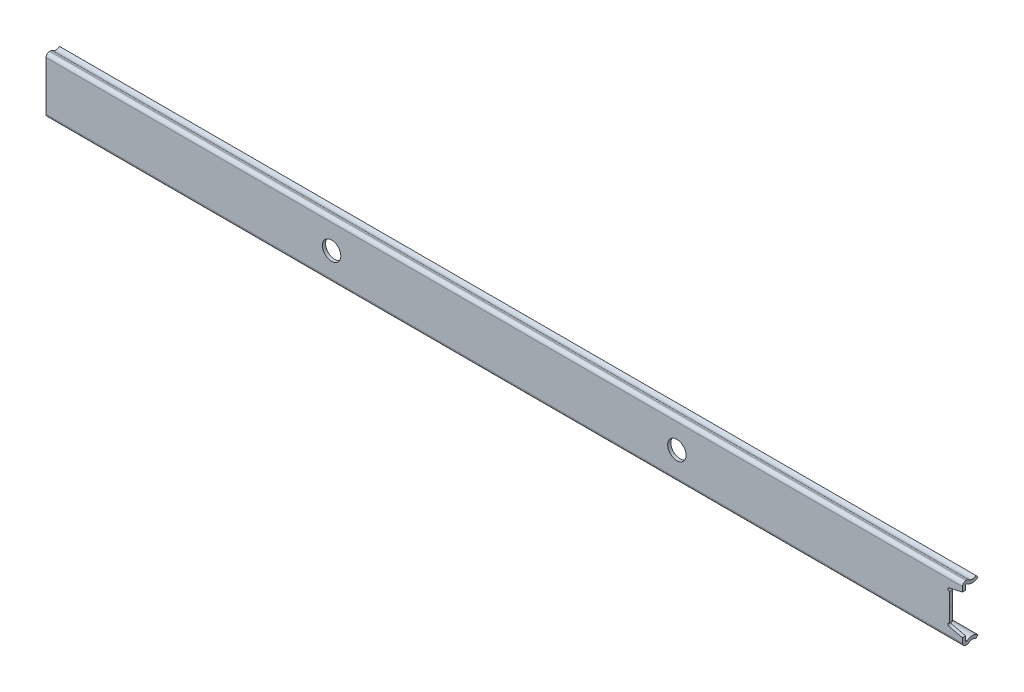
ISO-10303-21;
HEADER;
FILE_DESCRIPTION(('STEP AP214'),'2;1');
FILE_NAME('part.step','',(''),(''),'','','');
FILE_SCHEMA(('AUTOMOTIVE_DESIGN { 1 0 10303 214 1 1 1 1 }'));
ENDSEC;
DATA;
#1=APPLICATION_CONTEXT('core data for automotive mechanical design processes');
#2=APPLICATION_PROTOCOL_DEFINITION('international standard','automotive_design',2000,#1);
#3=PRODUCT_CONTEXT('',#1,'mechanical');
#4=PRODUCT('Part','Part','',(#3));
#5=PRODUCT_RELATED_PRODUCT_CATEGORY('part','',(#4));
#6=PRODUCT_DEFINITION_FORMATION('','',#4);
#7=PRODUCT_DEFINITION_CONTEXT('part definition',#1,'design');
#8=PRODUCT_DEFINITION('design','',#6,#7);
#9=PRODUCT_DEFINITION_SHAPE('','',#8);
#10=(LENGTH_UNIT() NAMED_UNIT(*) SI_UNIT(.MILLI.,.METRE.));
#11=(NAMED_UNIT(*) PLANE_ANGLE_UNIT() SI_UNIT($,.RADIAN.));
#12=(NAMED_UNIT(*) SI_UNIT($,.STERADIAN.) SOLID_ANGLE_UNIT());
#13=UNCERTAINTY_MEASURE_WITH_UNIT(LENGTH_MEASURE(1.E-05),#10,'distance_accuracy_value','');
#14=(GEOMETRIC_REPRESENTATION_CONTEXT(3) GLOBAL_UNCERTAINTY_ASSIGNED_CONTEXT((#13)) GLOBAL_UNIT_ASSIGNED_CONTEXT((#10,
#11,#12)) REPRESENTATION_CONTEXT('',''));
#15=CARTESIAN_POINT('',(0.,0.,0.));
#16=DIRECTION('',(0.,0.,1.));
#17=DIRECTION('',(1.,0.,0.));
#18=AXIS2_PLACEMENT_3D('',#15,#16,#17);
#19=CARTESIAN_POINT('',(-206.375,0.,5.6642));
#20=DIRECTION('',(0.,0.,-1.));
#21=DIRECTION('',(-1.,0.,0.));
#22=AXIS2_PLACEMENT_3D('',#19,#20,#21);
#23=PLANE('',#22);
#24=CARTESIAN_POINT('',(-480.4475,0.,5.6642));
#25=DIRECTION('',(0.,0.,-1.));
#26=DIRECTION('',(-1.,0.,0.));
#27=AXIS2_PLACEMENT_3D('',#24,#25,#26);
#28=CIRCLE('',#27,3.99999999999999);
#29=CARTESIAN_POINT('',(-484.4475,0.,5.6642));
#30=VERTEX_POINT('',#29);
#31=EDGE_CURVE('E508',#30,#30,#28,.T.);
#32=ORIENTED_EDGE('',*,*,#31,.F.);
#33=EDGE_LOOP('',(#32));
#34=FACE_BOUND('',#33,.T.);
#35=CARTESIAN_POINT('',(-330.4475,0.,5.6642));
#36=DIRECTION('',(0.,0.,-1.));
#37=DIRECTION('',(-1.,0.,0.));
#38=AXIS2_PLACEMENT_3D('',#35,#36,#37);
#39=CIRCLE('',#38,3.99999999999999);
#40=CARTESIAN_POINT('',(-334.4475,0.,5.6642));
#41=VERTEX_POINT('',#40);
#42=EDGE_CURVE('E237',#41,#41,#39,.T.);
#43=ORIENTED_EDGE('',*,*,#42,.F.);
#44=EDGE_LOOP('',(#43));
#45=FACE_BOUND('',#44,.T.);
#46=DIRECTION('',(-0.973808335896882,-0.227370457486774,0.));
#47=VECTOR('',#46,1.);
#48=CARTESIAN_POINT('',(-206.375,8.58928584446216,5.6642));
#49=LINE('',#48,#47);
#50=CARTESIAN_POINT('',(-206.375,8.58928584446216,5.6642));
#51=VERTEX_POINT('',#50);
#52=CARTESIAN_POINT('',(-212.234326456802,7.22121608377307,5.6642));
#53=VERTEX_POINT('',#52);
#54=EDGE_CURVE('E52',#51,#53,#49,.T.);
#55=ORIENTED_EDGE('',*,*,#54,.T.);
#56=CARTESIAN_POINT('',(-212.089946226526,6.60284783428301,5.6642));
#57=DIRECTION('',(0.,0.,-1.));
#58=DIRECTION('',(-1.,0.,0.));
#59=AXIS2_PLACEMENT_3D('',#56,#57,#58);
#60=CIRCLE('',#59,0.634999955017367);
#61=CARTESIAN_POINT('',(-212.089951397954,5.9678478792867,5.6642));
#62=VERTEX_POINT('',#61);
#63=EDGE_CURVE('E304',#53,#62,#60,.F.);
#64=ORIENTED_EDGE('',*,*,#63,.T.);
#65=DIRECTION('',(-8.14398201597397E-06,-0.999999999966838,0.));
#66=VECTOR('',#65,1.);
#67=CARTESIAN_POINT('',(-212.089951397954,5.9678478792867,5.6642));
#68=LINE('',#67,#66);
#69=CARTESIAN_POINT('',(-212.09,0.,5.6642));
#70=VERTEX_POINT('',#69);
#71=EDGE_CURVE('E241',#62,#70,#68,.T.);
#72=ORIENTED_EDGE('',*,*,#71,.T.);
#73=DIRECTION('',(-8.14398201597397E-06,0.999999999966838,0.));
#74=VECTOR('',#73,1.);
#75=CARTESIAN_POINT('',(-212.089951397954,-5.9678478792867,5.6642));
#76=LINE('',#75,#74);
#77=CARTESIAN_POINT('',(-212.089951397954,-5.9678478792867,5.6642));
#78=VERTEX_POINT('',#77);
#79=EDGE_CURVE('E220',#78,#70,#76,.T.);
#80=ORIENTED_EDGE('',*,*,#79,.F.);
#81=CARTESIAN_POINT('',(-212.089946226526,-6.60284783428301,5.6642));
#82=DIRECTION('',(0.,0.,1.));
#83=DIRECTION('',(-1.,0.,0.));
#84=AXIS2_PLACEMENT_3D('',#81,#82,#83);
#85=CIRCLE('',#84,0.634999955017367);
#86=CARTESIAN_POINT('',(-212.234326456802,-7.22121608377307,5.6642));
#87=VERTEX_POINT('',#86);
#88=EDGE_CURVE('E231',#87,#78,#85,.F.);
#89=ORIENTED_EDGE('',*,*,#88,.F.);
#90=DIRECTION('',(-0.973808335896882,0.227370457486774,0.));
#91=VECTOR('',#90,1.);
#92=CARTESIAN_POINT('',(-206.375,-8.58928584446216,5.6642));
#93=LINE('',#92,#91);
#94=CARTESIAN_POINT('',(-206.375,-8.58928584446216,5.6642));
#95=VERTEX_POINT('',#94);
#96=EDGE_CURVE('E236',#95,#87,#93,.T.);
#97=ORIENTED_EDGE('',*,*,#96,.F.);
#98=DIRECTION('',(0.,-1.,0.));
#99=VECTOR('',#98,1.);
#100=CARTESIAN_POINT('',(-206.375,0.,5.6642));
#101=LINE('',#100,#99);
#102=CARTESIAN_POINT('',(-206.375,-10.6234864827049,5.6642));
#103=VERTEX_POINT('',#102);
#104=EDGE_CURVE('E271',#103,#95,#101,.F.);
#105=ORIENTED_EDGE('',*,*,#104,.F.);
#106=DIRECTION('',(-1.,0.,0.));
#107=VECTOR('',#106,1.);
#108=CARTESIAN_POINT('',(-206.375,-10.6234864827049,5.6642));
#109=LINE('',#108,#107);
#110=CARTESIAN_POINT('',(-604.52,-10.6234864827049,5.6642));
#111=VERTEX_POINT('',#110);
#112=EDGE_CURVE('E301',#103,#111,#109,.T.);
#113=ORIENTED_EDGE('',*,*,#112,.T.);
#114=DIRECTION('',(0.,-1.,0.));
#115=VECTOR('',#114,1.);
#116=CARTESIAN_POINT('',(-604.52,0.,5.6642));
#117=LINE('',#116,#115);
#118=CARTESIAN_POINT('',(-604.52,10.6234864827049,5.6642));
#119=VERTEX_POINT('',#118);
#120=EDGE_CURVE('E374',#119,#111,#117,.T.);
#121=ORIENTED_EDGE('',*,*,#120,.F.);
#122=DIRECTION('',(-1.,0.,0.));
#123=VECTOR('',#122,1.);
#124=CARTESIAN_POINT('',(-206.375,10.6234864827049,5.6642));
#125=LINE('',#124,#123);
#126=CARTESIAN_POINT('',(-206.375,10.6234864827049,5.6642));
#127=VERTEX_POINT('',#126);
#128=EDGE_CURVE('E11',#127,#119,#125,.T.);
#129=ORIENTED_EDGE('',*,*,#128,.F.);
#130=DIRECTION('',(0.,1.,0.));
#131=VECTOR('',#130,1.);
#132=CARTESIAN_POINT('',(-206.375,0.,5.6642));
#133=LINE('',#132,#131);
#134=EDGE_CURVE('E376',#127,#51,#133,.F.);
#135=ORIENTED_EDGE('',*,*,#134,.T.);
#136=EDGE_LOOP('',(#55,#64,#72,#80,#89,#97,#105,#113,#121,#129,#135));
#137=FACE_BOUND('',#136,.T.);
#138=ADVANCED_FACE('F36',(#34,#45,#137),#23,.T.);
#139=CARTESIAN_POINT('',(-206.375,10.6234864827049,5.53720000000239));
#140=DIRECTION('',(-1.,0.,0.));
#141=DIRECTION('',(0.,0.,1.));
#142=AXIS2_PLACEMENT_3D('',#139,#140,#141);
#143=CYLINDRICAL_SURFACE('',#142,0.126999999997611);
#144=CARTESIAN_POINT('',(-604.52,10.6234864827049,5.53720000000239));
#145=DIRECTION('',(1.,0.,0.));
#146=DIRECTION('',(0.,0.,-1.));
#147=AXIS2_PLACEMENT_3D('',#144,#145,#146);
#148=CIRCLE('',#147,0.126999999997611);
#149=CARTESIAN_POINT('',(-604.52,10.7504864827025,5.53720000000239));
#150=VERTEX_POINT('',#149);
#151=EDGE_CURVE('E372',#150,#119,#148,.T.);
#152=ORIENTED_EDGE('',*,*,#151,.F.);
#153=DIRECTION('',(-1.,0.,0.));
#154=VECTOR('',#153,1.);
#155=CARTESIAN_POINT('',(-206.375,10.7504864827025,5.53720000000239));
#156=LINE('',#155,#154);
#157=CARTESIAN_POINT('',(-206.375,10.7504864827025,5.53720000000239));
#158=VERTEX_POINT('',#157);
#159=EDGE_CURVE('E44',#158,#150,#156,.T.);
#160=ORIENTED_EDGE('',*,*,#159,.F.);
#161=CARTESIAN_POINT('',(-206.375,10.6234864827049,5.53720000000239));
#162=DIRECTION('',(-1.,0.,0.));
#163=DIRECTION('',(0.,0.,1.));
#164=AXIS2_PLACEMENT_3D('',#161,#162,#163);
#165=CIRCLE('',#164,0.126999999997611);
#166=EDGE_CURVE('E400',#158,#127,#165,.F.);
#167=ORIENTED_EDGE('',*,*,#166,.T.);
#168=ORIENTED_EDGE('',*,*,#128,.T.);
#169=EDGE_LOOP('',(#152,#160,#167,#168));
#170=FACE_BOUND('',#169,.T.);
#171=ADVANCED_FACE('F470',(#170),#143,.F.);
#172=CARTESIAN_POINT('',(-206.375,10.7504864827025,5.53720000000239));
#173=DIRECTION('',(0.,-1.,0.));
#174=DIRECTION('',(0.,0.,-1.));
#175=AXIS2_PLACEMENT_3D('',#172,#173,#174);
#176=PLANE('',#175);
#177=DIRECTION('',(0.,0.,1.));
#178=VECTOR('',#177,1.);
#179=CARTESIAN_POINT('',(-604.52,10.7504864827025,5.53720000000239));
#180=LINE('',#179,#178);
#181=CARTESIAN_POINT('',(-604.52,10.7504864827025,5.16434145501836));
#182=VERTEX_POINT('',#181);
#183=EDGE_CURVE('E370',#182,#150,#180,.T.);
#184=ORIENTED_EDGE('',*,*,#183,.F.);
#185=DIRECTION('',(-1.,0.,0.));
#186=VECTOR('',#185,1.);
#187=CARTESIAN_POINT('',(-206.375,10.7504864827025,5.16434145501836));
#188=LINE('',#187,#186);
#189=CARTESIAN_POINT('',(-206.375,10.7504864827025,5.16434145501836));
#190=VERTEX_POINT('',#189);
#191=EDGE_CURVE('E405',#190,#182,#188,.T.);
#192=ORIENTED_EDGE('',*,*,#191,.F.);
#193=DIRECTION('',(0.,0.,1.));
#194=VECTOR('',#193,1.);
#195=CARTESIAN_POINT('',(-206.375,10.7504864827025,5.53720000000239));
#196=LINE('',#195,#194);
#197=EDGE_CURVE('E397',#190,#158,#196,.T.);
#198=ORIENTED_EDGE('',*,*,#197,.T.);
#199=ORIENTED_EDGE('',*,*,#159,.T.);
#200=EDGE_LOOP('',(#184,#192,#198,#199));
#201=FACE_BOUND('',#200,.T.);
#202=ADVANCED_FACE('F467',(#201),#176,.T.);
#203=CARTESIAN_POINT('',(-206.375,10.623486496186,5.16434145501836));
#204=DIRECTION('',(-1.,0.,0.));
#205=DIRECTION('',(0.,0.,1.));
#206=AXIS2_PLACEMENT_3D('',#203,#204,#205);
#207=CYLINDRICAL_SURFACE('',#206,0.126999986516504);
#208=CARTESIAN_POINT('',(-604.52,10.623486496186,5.16434145501836));
#209=DIRECTION('',(1.,0.,0.));
#210=DIRECTION('',(0.,0.,-1.));
#211=AXIS2_PLACEMENT_3D('',#208,#209,#210);
#212=CIRCLE('',#211,0.126999986516504);
#213=CARTESIAN_POINT('',(-604.52,10.724235862547,5.08702029521689));
#214=VERTEX_POINT('',#213);
#215=EDGE_CURVE('E368',#214,#182,#212,.T.);
#216=ORIENTED_EDGE('',*,*,#215,.F.);
#217=DIRECTION('',(-1.,0.,0.));
#218=VECTOR('',#217,1.);
#219=CARTESIAN_POINT('',(-206.375,10.724235862547,5.08702029521689));
#220=LINE('',#219,#218);
#221=CARTESIAN_POINT('',(-206.375,10.724235862547,5.08702029521689));
#222=VERTEX_POINT('',#221);
#223=EDGE_CURVE('E408',#222,#214,#220,.T.);
#224=ORIENTED_EDGE('',*,*,#223,.F.);
#225=CARTESIAN_POINT('',(-206.375,10.623486496186,5.16434145501836));
#226=DIRECTION('',(-1.,0.,0.));
#227=DIRECTION('',(0.,0.,1.));
#228=AXIS2_PLACEMENT_3D('',#225,#226,#227);
#229=CIRCLE('',#228,0.126999986516504);
#230=EDGE_CURVE('E394',#222,#190,#229,.F.);
#231=ORIENTED_EDGE('',*,*,#230,.T.);
#232=ORIENTED_EDGE('',*,*,#191,.T.);
#233=EDGE_LOOP('',(#216,#224,#231,#232));
#234=FACE_BOUND('',#233,.T.);
#235=ADVANCED_FACE('F460',(#234),#207,.F.);
#236=CARTESIAN_POINT('',(-206.375,13.7451343630532,2.7686));
#237=DIRECTION('',(-1.,0.,0.));
#238=DIRECTION('',(0.,0.,1.));
#239=AXIS2_PLACEMENT_3D('',#236,#237,#238);
#240=CYLINDRICAL_SURFACE('',#239,3.80800478146149);
#241=CARTESIAN_POINT('',(-604.52,13.7451343630532,2.7686));
#242=DIRECTION('',(1.,0.,0.));
#243=DIRECTION('',(0.,0.,-1.));
#244=AXIS2_PLACEMENT_3D('',#241,#242,#243);
#245=CIRCLE('',#244,3.80800478146149);
#246=CARTESIAN_POINT('',(-604.52,10.8422195776757,0.304054166693024));
#247=VERTEX_POINT('',#246);
#248=EDGE_CURVE('E366',#247,#214,#245,.F.);
#249=ORIENTED_EDGE('',*,*,#248,.F.);
#250=DIRECTION('',(-1.,0.,0.));
#251=VECTOR('',#250,1.);
#252=CARTESIAN_POINT('',(-206.375,10.8422195776757,0.304054166693023));
#253=LINE('',#252,#251);
#254=CARTESIAN_POINT('',(-206.375,10.8422195776757,0.304054166693023));
#255=VERTEX_POINT('',#254);
#256=EDGE_CURVE('E411',#255,#247,#253,.T.);
#257=ORIENTED_EDGE('',*,*,#256,.F.);
#258=CARTESIAN_POINT('',(-206.375,13.7451343630532,2.7686));
#259=DIRECTION('',(-1.,0.,0.));
#260=DIRECTION('',(0.,0.,1.));
#261=AXIS2_PLACEMENT_3D('',#258,#259,#260);
#262=CIRCLE('',#261,3.80800478146149);
#263=EDGE_CURVE('E391',#255,#222,#262,.T.);
#264=ORIENTED_EDGE('',*,*,#263,.T.);
#265=ORIENTED_EDGE('',*,*,#223,.T.);
#266=EDGE_LOOP('',(#249,#257,#264,#265));
#267=FACE_BOUND('',#266,.T.);
#268=ADVANCED_FACE('F457',(#267),#240,.T.);
#269=CARTESIAN_POINT('',(-206.375,10.8422195776757,0.304054166693023));
#270=DIRECTION('',(0.,-0.647201349458679,0.762319101990017));
#271=DIRECTION('',(0.,-0.762319101990017,-0.647201349458679));
#272=AXIS2_PLACEMENT_3D('',#269,#270,#271);
#273=PLANE('',#272);
#274=ORIENTED_EDGE('',*,*,#256,.T.);
#275=DIRECTION('',(0.,0.762319101990017,0.647201349458679));
#276=VECTOR('',#275,1.);
#277=CARTESIAN_POINT('',(-604.52,10.8422195776757,0.304054166693023));
#278=LINE('',#277,#276);
#279=CARTESIAN_POINT('',(-604.52,11.9071793631558,1.2081944518868));
#280=VERTEX_POINT('',#279);
#281=EDGE_CURVE('E363',#247,#280,#278,.T.);
#282=ORIENTED_EDGE('',*,*,#281,.T.);
#283=DIRECTION('',(-1.,0.,0.));
#284=VECTOR('',#283,1.);
#285=CARTESIAN_POINT('',(-206.375,11.9071793631558,1.2081944518868));
#286=LINE('',#285,#284);
#287=CARTESIAN_POINT('',(-206.375,11.9071793631558,1.2081944518868));
#288=VERTEX_POINT('',#287);
#289=EDGE_CURVE('E414',#288,#280,#286,.T.);
#290=ORIENTED_EDGE('',*,*,#289,.F.);
#291=DIRECTION('',(0.,0.762319101990017,0.647201349458679));
#292=VECTOR('',#291,1.);
#293=CARTESIAN_POINT('',(-206.375,10.8422195776757,0.304054166693023));
#294=LINE('',#293,#292);
#295=EDGE_CURVE('E389',#255,#288,#294,.T.);
#296=ORIENTED_EDGE('',*,*,#295,.F.);
#297=EDGE_LOOP('',(#274,#282,#290,#296));
#298=FACE_BOUND('',#297,.T.);
#299=ADVANCED_FACE('F452',(#298),#273,.F.);
#300=CARTESIAN_POINT('',(-206.375,13.7451343630532,2.7686));
#301=DIRECTION('',(-1.,0.,0.));
#302=DIRECTION('',(0.,0.,1.));
#303=AXIS2_PLACEMENT_3D('',#300,#301,#302);
#304=CYLINDRICAL_SURFACE('',#303,2.41100478146149);
#305=ORIENTED_EDGE('',*,*,#289,.T.);
#306=CARTESIAN_POINT('',(-604.52,13.7451343630532,2.7686));
#307=DIRECTION('',(1.,0.,0.));
#308=DIRECTION('',(0.,0.,-1.));
#309=AXIS2_PLACEMENT_3D('',#306,#307,#308);
#310=CIRCLE('',#309,2.41100478146149);
#311=CARTESIAN_POINT('',(-604.52,11.8324790101797,4.23648744710031));
#312=VERTEX_POINT('',#311);
#313=EDGE_CURVE('E360',#280,#312,#310,.F.);
#314=ORIENTED_EDGE('',*,*,#313,.T.);
#315=DIRECTION('',(-1.,0.,0.));
#316=VECTOR('',#315,1.);
#317=CARTESIAN_POINT('',(-206.375,11.8324790101797,4.23648744710031));
#318=LINE('',#317,#316);
#319=CARTESIAN_POINT('',(-206.375,11.8324790101797,4.23648744710031));
#320=VERTEX_POINT('',#319);
#321=EDGE_CURVE('E417',#320,#312,#318,.T.);
#322=ORIENTED_EDGE('',*,*,#321,.F.);
#323=CARTESIAN_POINT('',(-206.375,13.7451343630532,2.7686));
#324=DIRECTION('',(-1.,0.,0.));
#325=DIRECTION('',(0.,0.,1.));
#326=AXIS2_PLACEMENT_3D('',#323,#324,#325);
#327=CIRCLE('',#326,2.41100478146149);
#328=EDGE_CURVE('E387',#288,#320,#327,.T.);
#329=ORIENTED_EDGE('',*,*,#328,.F.);
#330=EDGE_LOOP('',(#305,#314,#322,#329));
#331=FACE_BOUND('',#330,.T.);
#332=ADVANCED_FACE('F447',(#331),#304,.F.);
#333=CARTESIAN_POINT('',(-206.375,10.623486496186,5.16434145501836));
#334=DIRECTION('',(-1.,0.,0.));
#335=DIRECTION('',(0.,0.,1.));
#336=AXIS2_PLACEMENT_3D('',#333,#334,#335);
#337=CYLINDRICAL_SURFACE('',#336,1.5239999865165);
#338=ORIENTED_EDGE('',*,*,#321,.T.);
#339=CARTESIAN_POINT('',(-604.52,10.623486496186,5.16434145501836));
#340=DIRECTION('',(1.,0.,0.));
#341=DIRECTION('',(0.,0.,-1.));
#342=AXIS2_PLACEMENT_3D('',#339,#340,#341);
#343=CIRCLE('',#342,1.5239999865165);
#344=CARTESIAN_POINT('',(-604.52,12.1474864827025,5.16434145501836));
#345=VERTEX_POINT('',#344);
#346=EDGE_CURVE('E357',#312,#345,#343,.T.);
#347=ORIENTED_EDGE('',*,*,#346,.T.);
#348=DIRECTION('',(-1.,0.,0.));
#349=VECTOR('',#348,1.);
#350=CARTESIAN_POINT('',(-206.375,12.1474864827025,5.16434145501836));
#351=LINE('',#350,#349);
#352=CARTESIAN_POINT('',(-206.375,12.1474864827025,5.16434145501836));
#353=VERTEX_POINT('',#352);
#354=EDGE_CURVE('E420',#353,#345,#351,.T.);
#355=ORIENTED_EDGE('',*,*,#354,.F.);
#356=CARTESIAN_POINT('',(-206.375,10.623486496186,5.16434145501836));
#357=DIRECTION('',(1.,0.,0.));
#358=DIRECTION('',(0.,0.,1.));
#359=AXIS2_PLACEMENT_3D('',#356,#357,#358);
#360=CIRCLE('',#359,1.5239999865165);
#361=EDGE_CURVE('E385',#320,#353,#360,.T.);
#362=ORIENTED_EDGE('',*,*,#361,.F.);
#363=EDGE_LOOP('',(#338,#347,#355,#362));
#364=FACE_BOUND('',#363,.T.);
#365=ADVANCED_FACE('F444',(#364),#337,.T.);
#366=CARTESIAN_POINT('',(-206.375,12.1474864827025,5.53720000000239));
#367=DIRECTION('',(0.,-1.,0.));
#368=DIRECTION('',(0.,0.,-1.));
#369=AXIS2_PLACEMENT_3D('',#366,#367,#368);
#370=PLANE('',#369);
#371=ORIENTED_EDGE('',*,*,#354,.T.);
#372=DIRECTION('',(0.,0.,1.));
#373=VECTOR('',#372,1.);
#374=CARTESIAN_POINT('',(-604.52,12.1474864827025,-5.6388));
#375=LINE('',#374,#373);
#376=CARTESIAN_POINT('',(-604.52,12.1474864827025,5.53720000000239));
#377=VERTEX_POINT('',#376);
#378=EDGE_CURVE('E351',#345,#377,#375,.T.);
#379=ORIENTED_EDGE('',*,*,#378,.T.);
#380=DIRECTION('',(-1.,0.,0.));
#381=VECTOR('',#380,1.);
#382=CARTESIAN_POINT('',(-206.375,12.1474864827025,5.53720000000239));
#383=LINE('',#382,#381);
#384=CARTESIAN_POINT('',(-206.375,12.1474864827025,5.53720000000239));
#385=VERTEX_POINT('',#384);
#386=EDGE_CURVE('E422',#385,#377,#383,.T.);
#387=ORIENTED_EDGE('',*,*,#386,.F.);
#388=DIRECTION('',(0.,0.,1.));
#389=VECTOR('',#388,1.);
#390=CARTESIAN_POINT('',(-206.375,12.1474864827025,5.53720000000239));
#391=LINE('',#390,#389);
#392=EDGE_CURVE('E383',#353,#385,#391,.T.);
#393=ORIENTED_EDGE('',*,*,#392,.F.);
#394=EDGE_LOOP('',(#371,#379,#387,#393));
#395=FACE_BOUND('',#394,.T.);
#396=ADVANCED_FACE('F439',(#395),#370,.F.);
#397=CARTESIAN_POINT('',(-206.375,10.6234864827049,5.53720000000239));
#398=DIRECTION('',(-1.,0.,0.));
#399=DIRECTION('',(0.,0.,1.));
#400=AXIS2_PLACEMENT_3D('',#397,#398,#399);
#401=CYLINDRICAL_SURFACE('',#400,1.52399999999761);
#402=ORIENTED_EDGE('',*,*,#386,.T.);
#403=CARTESIAN_POINT('',(-604.52,10.6234864827049,5.53720000000239));
#404=DIRECTION('',(1.,0.,0.));
#405=DIRECTION('',(0.,0.,-1.));
#406=AXIS2_PLACEMENT_3D('',#403,#404,#405);
#407=CIRCLE('',#406,1.52399999999761);
#408=CARTESIAN_POINT('',(-604.52,10.6234864827049,7.0612));
#409=VERTEX_POINT('',#408);
#410=EDGE_CURVE('E354',#377,#409,#407,.T.);
#411=ORIENTED_EDGE('',*,*,#410,.T.);
#412=DIRECTION('',(-1.,0.,0.));
#413=VECTOR('',#412,1.);
#414=CARTESIAN_POINT('',(-206.375,10.6234864827049,7.0612));
#415=LINE('',#414,#413);
#416=CARTESIAN_POINT('',(-206.375,10.6234864827049,7.0612));
#417=VERTEX_POINT('',#416);
#418=EDGE_CURVE('E39',#417,#409,#415,.T.);
#419=ORIENTED_EDGE('',*,*,#418,.F.);
#420=CARTESIAN_POINT('',(-206.375,10.6234864827049,5.53720000000239));
#421=DIRECTION('',(1.,0.,0.));
#422=DIRECTION('',(0.,0.,1.));
#423=AXIS2_PLACEMENT_3D('',#420,#421,#422);
#424=CIRCLE('',#423,1.52399999999761);
#425=EDGE_CURVE('E381',#385,#417,#424,.T.);
#426=ORIENTED_EDGE('',*,*,#425,.F.);
#427=EDGE_LOOP('',(#402,#411,#419,#426));
#428=FACE_BOUND('',#427,.T.);
#429=ADVANCED_FACE('F435',(#428),#401,.T.);
#430=CARTESIAN_POINT('',(-206.375,0.,7.0612));
#431=DIRECTION('',(0.,0.,-1.));
#432=DIRECTION('',(-1.,0.,0.));
#433=AXIS2_PLACEMENT_3D('',#430,#431,#432);
#434=PLANE('',#433);
#435=CARTESIAN_POINT('',(-480.4475,0.,7.0612));
#436=DIRECTION('',(0.,0.,1.));
#437=DIRECTION('',(1.,0.,0.));
#438=AXIS2_PLACEMENT_3D('',#435,#436,#437);
#439=CIRCLE('',#438,3.99999999999999);
#440=CARTESIAN_POINT('',(-476.4475,0.,7.0612));
#441=VERTEX_POINT('',#440);
#442=EDGE_CURVE('E503',#441,#441,#439,.T.);
#443=ORIENTED_EDGE('',*,*,#442,.F.);
#444=EDGE_LOOP('',(#443));
#445=FACE_BOUND('',#444,.T.);
#446=CARTESIAN_POINT('',(-330.4475,0.,7.0612));
#447=DIRECTION('',(0.,0.,1.));
#448=DIRECTION('',(1.,0.,0.));
#449=AXIS2_PLACEMENT_3D('',#446,#447,#448);
#450=CIRCLE('',#449,3.99999999999999);
#451=CARTESIAN_POINT('',(-326.4475,0.,7.0612));
#452=VERTEX_POINT('',#451);
#453=EDGE_CURVE('E506',#452,#452,#450,.T.);
#454=ORIENTED_EDGE('',*,*,#453,.F.);
#455=EDGE_LOOP('',(#454));
#456=FACE_BOUND('',#455,.T.);
#457=CARTESIAN_POINT('',(-212.089946226526,6.60284783428301,7.0612));
#458=DIRECTION('',(0.,0.,1.));
#459=DIRECTION('',(1.,0.,0.));
#460=AXIS2_PLACEMENT_3D('',#457,#458,#459);
#461=CIRCLE('',#460,0.634999955017367);
#462=CARTESIAN_POINT('',(-212.234326456802,7.22121608377307,7.0612));
#463=VERTEX_POINT('',#462);
#464=CARTESIAN_POINT('',(-212.089951397954,5.9678478792867,7.0612));
#465=VERTEX_POINT('',#464);
#466=EDGE_CURVE('E333',#463,#465,#461,.T.);
#467=ORIENTED_EDGE('',*,*,#466,.F.);
#468=DIRECTION('',(-0.973808335896882,-0.227370457486774,0.));
#469=VECTOR('',#468,1.);
#470=CARTESIAN_POINT('',(-206.375,8.58928584446216,7.0612));
#471=LINE('',#470,#469);
#472=CARTESIAN_POINT('',(-206.375,8.58928584446216,7.0612));
#473=VERTEX_POINT('',#472);
#474=EDGE_CURVE('E339',#473,#463,#471,.T.);
#475=ORIENTED_EDGE('',*,*,#474,.F.);
#476=DIRECTION('',(0.,-1.,0.));
#477=VECTOR('',#476,1.);
#478=CARTESIAN_POINT('',(-206.375,0.,7.0612));
#479=LINE('',#478,#477);
#480=EDGE_CURVE('E378',#417,#473,#479,.T.);
#481=ORIENTED_EDGE('',*,*,#480,.F.);
#482=ORIENTED_EDGE('',*,*,#418,.T.);
#483=DIRECTION('',(0.,1.,0.));
#484=VECTOR('',#483,1.);
#485=CARTESIAN_POINT('',(-604.52,0.,7.0612));
#486=LINE('',#485,#484);
#487=CARTESIAN_POINT('',(-604.52,-10.6234864827049,7.0612));
#488=VERTEX_POINT('',#487);
#489=EDGE_CURVE('E349',#488,#409,#486,.T.);
#490=ORIENTED_EDGE('',*,*,#489,.F.);
#491=DIRECTION('',(-1.,0.,0.));
#492=VECTOR('',#491,1.);
#493=CARTESIAN_POINT('',(-206.375,-10.6234864827049,7.0612));
#494=LINE('',#493,#492);
#495=CARTESIAN_POINT('',(-206.375,-10.6234864827049,7.0612));
#496=VERTEX_POINT('',#495);
#497=EDGE_CURVE('E300',#496,#488,#494,.T.);
#498=ORIENTED_EDGE('',*,*,#497,.F.);
#499=DIRECTION('',(0.,1.,0.));
#500=VECTOR('',#499,1.);
#501=CARTESIAN_POINT('',(-206.375,0.,7.0612));
#502=LINE('',#501,#500);
#503=CARTESIAN_POINT('',(-206.375,-8.58928584446216,7.0612));
#504=VERTEX_POINT('',#503);
#505=EDGE_CURVE('E274',#496,#504,#502,.T.);
#506=ORIENTED_EDGE('',*,*,#505,.T.);
#507=DIRECTION('',(-0.973808335896882,0.227370457486774,0.));
#508=VECTOR('',#507,1.);
#509=CARTESIAN_POINT('',(-206.375,-8.58928584446216,7.0612));
#510=LINE('',#509,#508);
#511=CARTESIAN_POINT('',(-212.234326456802,-7.22121608377307,7.0612));
#512=VERTEX_POINT('',#511);
#513=EDGE_CURVE('E228',#504,#512,#510,.T.);
#514=ORIENTED_EDGE('',*,*,#513,.T.);
#515=CARTESIAN_POINT('',(-212.089946226526,-6.60284783428301,7.0612));
#516=DIRECTION('',(0.,0.,-1.));
#517=DIRECTION('',(1.,0.,0.));
#518=AXIS2_PLACEMENT_3D('',#515,#516,#517);
#519=CIRCLE('',#518,0.634999955017367);
#520=CARTESIAN_POINT('',(-212.089951397954,-5.9678478792867,7.0612));
#521=VERTEX_POINT('',#520);
#522=EDGE_CURVE('E517',#512,#521,#519,.T.);
#523=ORIENTED_EDGE('',*,*,#522,.T.);
#524=DIRECTION('',(-8.14398201597397E-06,0.999999999966838,0.));
#525=VECTOR('',#524,1.);
#526=CARTESIAN_POINT('',(-212.089951397954,-5.9678478792867,7.0612));
#527=LINE('',#526,#525);
#528=CARTESIAN_POINT('',(-212.09,0.,7.0612));
#529=VERTEX_POINT('',#528);
#530=EDGE_CURVE('E223',#521,#529,#527,.T.);
#531=ORIENTED_EDGE('',*,*,#530,.T.);
#532=DIRECTION('',(-8.14398201597397E-06,-0.999999999966838,0.));
#533=VECTOR('',#532,1.);
#534=CARTESIAN_POINT('',(-212.089951397954,5.9678478792867,7.0612));
#535=LINE('',#534,#533);
#536=EDGE_CURVE('E336',#465,#529,#535,.T.);
#537=ORIENTED_EDGE('',*,*,#536,.F.);
#538=EDGE_LOOP('',(#467,#475,#481,#482,#490,#498,#506,#514,#523,#531,#537));
#539=FACE_BOUND('',#538,.T.);
#540=ADVANCED_FACE('F432',(#445,#456,#539),#434,.F.);
#541=CARTESIAN_POINT('',(-206.375,10.6234864827049,5.53720000000239));
#542=DIRECTION('',(1.,0.,0.));
#543=DIRECTION('',(0.,0.,-1.));
#544=AXIS2_PLACEMENT_3D('',#541,#542,#543);
#545=PLANE('',#544);
#546=DIRECTION('',(0.,0.,1.));
#547=VECTOR('',#546,1.);
#548=CARTESIAN_POINT('',(-206.375,8.58928584446216,-5.6398));
#549=LINE('',#548,#547);
#550=EDGE_CURVE('E345',#51,#473,#549,.T.);
#551=ORIENTED_EDGE('',*,*,#550,.F.);
#552=ORIENTED_EDGE('',*,*,#134,.F.);
#553=ORIENTED_EDGE('',*,*,#166,.F.);
#554=ORIENTED_EDGE('',*,*,#197,.F.);
#555=ORIENTED_EDGE('',*,*,#230,.F.);
#556=ORIENTED_EDGE('',*,*,#263,.F.);
#557=ORIENTED_EDGE('',*,*,#295,.T.);
#558=ORIENTED_EDGE('',*,*,#328,.T.);
#559=ORIENTED_EDGE('',*,*,#361,.T.);
#560=ORIENTED_EDGE('',*,*,#392,.T.);
#561=ORIENTED_EDGE('',*,*,#425,.T.);
#562=ORIENTED_EDGE('',*,*,#480,.T.);
#563=EDGE_LOOP('',(#551,#552,#553,#554,#555,#556,#557,#558,#559,#560,#561,#562));
#564=FACE_BOUND('',#563,.T.);
#565=ADVANCED_FACE('F463',(#564),#545,.T.);
#566=CARTESIAN_POINT('',(-604.52,0.,-5.6388));
#567=DIRECTION('',(1.,0.,0.));
#568=DIRECTION('',(0.,0.,-1.));
#569=AXIS2_PLACEMENT_3D('',#566,#567,#568);
#570=PLANE('',#569);
#571=ORIENTED_EDGE('',*,*,#120,.T.);
#572=CARTESIAN_POINT('',(-604.52,-10.6234864827049,5.53720000000239));
#573=DIRECTION('',(-1.,0.,0.));
#574=DIRECTION('',(0.,0.,-1.));
#575=AXIS2_PLACEMENT_3D('',#572,#573,#574);
#576=CIRCLE('',#575,0.126999999997611);
#577=CARTESIAN_POINT('',(-604.52,-10.7504864827025,5.53720000000239));
#578=VERTEX_POINT('',#577);
#579=EDGE_CURVE('E268',#578,#111,#576,.T.);
#580=ORIENTED_EDGE('',*,*,#579,.F.);
#581=DIRECTION('',(0.,0.,1.));
#582=VECTOR('',#581,1.);
#583=CARTESIAN_POINT('',(-604.52,-10.7504864827025,5.53720000000239));
#584=LINE('',#583,#582);
#585=CARTESIAN_POINT('',(-604.52,-10.7504864827025,5.16434145501836));
#586=VERTEX_POINT('',#585);
#587=EDGE_CURVE('E266',#586,#578,#584,.T.);
#588=ORIENTED_EDGE('',*,*,#587,.F.);
#589=CARTESIAN_POINT('',(-604.52,-10.623486496186,5.16434145501836));
#590=DIRECTION('',(-1.,0.,0.));
#591=DIRECTION('',(0.,0.,-1.));
#592=AXIS2_PLACEMENT_3D('',#589,#590,#591);
#593=CIRCLE('',#592,0.126999986516504);
#594=CARTESIAN_POINT('',(-604.52,-10.724235862547,5.08702029521689));
#595=VERTEX_POINT('',#594);
#596=EDGE_CURVE('E264',#595,#586,#593,.T.);
#597=ORIENTED_EDGE('',*,*,#596,.F.);
#598=CARTESIAN_POINT('',(-604.52,-13.7451343630532,2.7686));
#599=DIRECTION('',(-1.,0.,0.));
#600=DIRECTION('',(0.,0.,-1.));
#601=AXIS2_PLACEMENT_3D('',#598,#599,#600);
#602=CIRCLE('',#601,3.80800478146149);
#603=CARTESIAN_POINT('',(-604.52,-10.8422195776757,0.304054166693024));
#604=VERTEX_POINT('',#603);
#605=EDGE_CURVE('E262',#604,#595,#602,.F.);
#606=ORIENTED_EDGE('',*,*,#605,.F.);
#607=DIRECTION('',(0.,-0.762319101990017,0.647201349458679));
#608=VECTOR('',#607,1.);
#609=CARTESIAN_POINT('',(-604.52,-10.8422195776757,0.304054166693023));
#610=LINE('',#609,#608);
#611=CARTESIAN_POINT('',(-604.52,-11.9071793631558,1.2081944518868));
#612=VERTEX_POINT('',#611);
#613=EDGE_CURVE('E259',#604,#612,#610,.T.);
#614=ORIENTED_EDGE('',*,*,#613,.T.);
#615=CARTESIAN_POINT('',(-604.52,-13.7451343630532,2.7686));
#616=DIRECTION('',(-1.,0.,0.));
#617=DIRECTION('',(0.,0.,-1.));
#618=AXIS2_PLACEMENT_3D('',#615,#616,#617);
#619=CIRCLE('',#618,2.41100478146149);
#620=CARTESIAN_POINT('',(-604.52,-11.8324790101797,4.23648744710031));
#621=VERTEX_POINT('',#620);
#622=EDGE_CURVE('E256',#612,#621,#619,.F.);
#623=ORIENTED_EDGE('',*,*,#622,.T.);
#624=CARTESIAN_POINT('',(-604.52,-10.623486496186,5.16434145501836));
#625=DIRECTION('',(-1.,0.,0.));
#626=DIRECTION('',(0.,0.,-1.));
#627=AXIS2_PLACEMENT_3D('',#624,#625,#626);
#628=CIRCLE('',#627,1.5239999865165);
#629=CARTESIAN_POINT('',(-604.52,-12.1474864827025,5.16434145501836));
#630=VERTEX_POINT('',#629);
#631=EDGE_CURVE('E253',#621,#630,#628,.T.);
#632=ORIENTED_EDGE('',*,*,#631,.T.);
#633=DIRECTION('',(0.,0.,1.));
#634=VECTOR('',#633,1.);
#635=CARTESIAN_POINT('',(-604.52,-12.1474864827025,-5.6388));
#636=LINE('',#635,#634);
#637=CARTESIAN_POINT('',(-604.52,-12.1474864827025,5.53720000000239));
#638=VERTEX_POINT('',#637);
#639=EDGE_CURVE('E242',#630,#638,#636,.T.);
#640=ORIENTED_EDGE('',*,*,#639,.T.);
#641=CARTESIAN_POINT('',(-604.52,-10.6234864827049,5.53720000000239));
#642=DIRECTION('',(-1.,0.,0.));
#643=DIRECTION('',(0.,0.,-1.));
#644=AXIS2_PLACEMENT_3D('',#641,#642,#643);
#645=CIRCLE('',#644,1.52399999999761);
#646=EDGE_CURVE('E245',#638,#488,#645,.T.);
#647=ORIENTED_EDGE('',*,*,#646,.T.);
#648=ORIENTED_EDGE('',*,*,#489,.T.);
#649=ORIENTED_EDGE('',*,*,#410,.F.);
#650=ORIENTED_EDGE('',*,*,#378,.F.);
#651=ORIENTED_EDGE('',*,*,#346,.F.);
#652=ORIENTED_EDGE('',*,*,#313,.F.);
#653=ORIENTED_EDGE('',*,*,#281,.F.);
#654=ORIENTED_EDGE('',*,*,#248,.T.);
#655=ORIENTED_EDGE('',*,*,#215,.T.);
#656=ORIENTED_EDGE('',*,*,#183,.T.);
#657=ORIENTED_EDGE('',*,*,#151,.T.);
#658=EDGE_LOOP('',(#571,#580,#588,#597,#606,#614,#623,#632,#640,#647,#648,#649,#650,#651,#652,
#653,#654,#655,#656,#657));
#659=FACE_BOUND('',#658,.T.);
#660=ADVANCED_FACE('F437',(#659),#570,.F.);
#661=CARTESIAN_POINT('',(-212.089946226526,6.60284783428301,-5.6398));
#662=DIRECTION('',(0.,0.,1.));
#663=DIRECTION('',(1.,0.,0.));
#664=AXIS2_PLACEMENT_3D('',#661,#662,#663);
#665=CYLINDRICAL_SURFACE('',#664,0.634999955017367);
#666=DIRECTION('',(0.,0.,1.));
#667=VECTOR('',#666,1.);
#668=CARTESIAN_POINT('',(-212.234326456802,7.22121608377307,-5.6398));
#669=LINE('',#668,#667);
#670=EDGE_CURVE('E343',#53,#463,#669,.T.);
#671=ORIENTED_EDGE('',*,*,#670,.T.);
#672=ORIENTED_EDGE('',*,*,#466,.T.);
#673=DIRECTION('',(0.,0.,1.));
#674=VECTOR('',#673,1.);
#675=CARTESIAN_POINT('',(-212.089951397954,5.9678478792867,-5.6398));
#676=LINE('',#675,#674);
#677=EDGE_CURVE('E342',#62,#465,#676,.T.);
#678=ORIENTED_EDGE('',*,*,#677,.F.);
#679=ORIENTED_EDGE('',*,*,#63,.F.);
#680=EDGE_LOOP('',(#671,#672,#678,#679));
#681=FACE_BOUND('',#680,.T.);
#682=ADVANCED_FACE('F527',(#681),#665,.F.);
#683=CARTESIAN_POINT('',(-206.375,8.58928584446216,-5.6398));
#684=DIRECTION('',(-0.227370457486774,0.973808335896882,0.));
#685=DIRECTION('',(-0.973808335896882,-0.227370457486774,0.));
#686=AXIS2_PLACEMENT_3D('',#683,#684,#685);
#687=PLANE('',#686);
#688=ORIENTED_EDGE('',*,*,#550,.T.);
#689=ORIENTED_EDGE('',*,*,#474,.T.);
#690=ORIENTED_EDGE('',*,*,#670,.F.);
#691=ORIENTED_EDGE('',*,*,#54,.F.);
#692=EDGE_LOOP('',(#688,#689,#690,#691));
#693=FACE_BOUND('',#692,.T.);
#694=ADVANCED_FACE('F528',(#693),#687,.F.);
#695=CARTESIAN_POINT('',(-212.089951397954,5.9678478792867,-5.6398));
#696=DIRECTION('',(-0.999999999966838,8.14398201597397E-06,0.));
#697=DIRECTION('',(-8.14398201597397E-06,-0.999999999966838,0.));
#698=AXIS2_PLACEMENT_3D('',#695,#696,#697);
#699=PLANE('',#698);
#700=ORIENTED_EDGE('',*,*,#677,.T.);
#701=ORIENTED_EDGE('',*,*,#536,.T.);
#702=DIRECTION('',(0.,0.,1.));
#703=VECTOR('',#702,1.);
#704=CARTESIAN_POINT('',(-212.09,0.,-5.6398));
#705=LINE('',#704,#703);
#706=EDGE_CURVE('E227',#70,#529,#705,.T.);
#707=ORIENTED_EDGE('',*,*,#706,.F.);
#708=ORIENTED_EDGE('',*,*,#71,.F.);
#709=EDGE_LOOP('',(#700,#701,#707,#708));
#710=FACE_BOUND('',#709,.T.);
#711=ADVANCED_FACE('F524',(#710),#699,.F.);
#712=CARTESIAN_POINT('',(-206.375,-10.6234864827049,5.53720000000239));
#713=DIRECTION('',(-1.,0.,0.));
#714=DIRECTION('',(0.,0.,1.));
#715=AXIS2_PLACEMENT_3D('',#712,#713,#714);
#716=CYLINDRICAL_SURFACE('',#715,0.126999999997611);
#717=ORIENTED_EDGE('',*,*,#579,.T.);
#718=ORIENTED_EDGE('',*,*,#112,.F.);
#719=CARTESIAN_POINT('',(-206.375,-10.6234864827049,5.53720000000239));
#720=DIRECTION('',(1.,0.,0.));
#721=DIRECTION('',(0.,0.,1.));
#722=AXIS2_PLACEMENT_3D('',#719,#720,#721);
#723=CIRCLE('',#722,0.126999999997611);
#724=CARTESIAN_POINT('',(-206.375,-10.7504864827025,5.53720000000239));
#725=VERTEX_POINT('',#724);
#726=EDGE_CURVE('E298',#725,#103,#723,.F.);
#727=ORIENTED_EDGE('',*,*,#726,.F.);
#728=DIRECTION('',(-1.,0.,0.));
#729=VECTOR('',#728,1.);
#730=CARTESIAN_POINT('',(-206.375,-10.7504864827025,5.53720000000239));
#731=LINE('',#730,#729);
#732=EDGE_CURVE('E305',#725,#578,#731,.T.);
#733=ORIENTED_EDGE('',*,*,#732,.T.);
#734=EDGE_LOOP('',(#717,#718,#727,#733));
#735=FACE_BOUND('',#734,.T.);
#736=ADVANCED_FACE('F535',(#735),#716,.F.);
#737=CARTESIAN_POINT('',(-206.375,-10.7504864827025,5.53720000000239));
#738=DIRECTION('',(0.,1.,0.));
#739=DIRECTION('',(0.,0.,-1.));
#740=AXIS2_PLACEMENT_3D('',#737,#738,#739);
#741=PLANE('',#740);
#742=ORIENTED_EDGE('',*,*,#587,.T.);
#743=ORIENTED_EDGE('',*,*,#732,.F.);
#744=DIRECTION('',(0.,0.,1.));
#745=VECTOR('',#744,1.);
#746=CARTESIAN_POINT('',(-206.375,-10.7504864827025,5.53720000000239));
#747=LINE('',#746,#745);
#748=CARTESIAN_POINT('',(-206.375,-10.7504864827025,5.16434145501836));
#749=VERTEX_POINT('',#748);
#750=EDGE_CURVE('E296',#749,#725,#747,.T.);
#751=ORIENTED_EDGE('',*,*,#750,.F.);
#752=DIRECTION('',(-1.,0.,0.));
#753=VECTOR('',#752,1.);
#754=CARTESIAN_POINT('',(-206.375,-10.7504864827025,5.16434145501836));
#755=LINE('',#754,#753);
#756=EDGE_CURVE('E308',#749,#586,#755,.T.);
#757=ORIENTED_EDGE('',*,*,#756,.T.);
#758=EDGE_LOOP('',(#742,#743,#751,#757));
#759=FACE_BOUND('',#758,.T.);
#760=ADVANCED_FACE('F639',(#759),#741,.T.);
#761=CARTESIAN_POINT('',(-206.375,-10.623486496186,5.16434145501836));
#762=DIRECTION('',(-1.,0.,0.));
#763=DIRECTION('',(0.,0.,1.));
#764=AXIS2_PLACEMENT_3D('',#761,#762,#763);
#765=CYLINDRICAL_SURFACE('',#764,0.126999986516504);
#766=ORIENTED_EDGE('',*,*,#596,.T.);
#767=ORIENTED_EDGE('',*,*,#756,.F.);
#768=CARTESIAN_POINT('',(-206.375,-10.623486496186,5.16434145501836));
#769=DIRECTION('',(1.,0.,0.));
#770=DIRECTION('',(0.,0.,1.));
#771=AXIS2_PLACEMENT_3D('',#768,#769,#770);
#772=CIRCLE('',#771,0.126999986516504);
#773=CARTESIAN_POINT('',(-206.375,-10.724235862547,5.08702029521689));
#774=VERTEX_POINT('',#773);
#775=EDGE_CURVE('E294',#774,#749,#772,.F.);
#776=ORIENTED_EDGE('',*,*,#775,.F.);
#777=DIRECTION('',(-1.,0.,0.));
#778=VECTOR('',#777,1.);
#779=CARTESIAN_POINT('',(-206.375,-10.724235862547,5.08702029521689));
#780=LINE('',#779,#778);
#781=EDGE_CURVE('E311',#774,#595,#780,.T.);
#782=ORIENTED_EDGE('',*,*,#781,.T.);
#783=EDGE_LOOP('',(#766,#767,#776,#782));
#784=FACE_BOUND('',#783,.T.);
#785=ADVANCED_FACE('F648',(#784),#765,.F.);
#786=CARTESIAN_POINT('',(-206.375,-13.7451343630532,2.7686));
#787=DIRECTION('',(-1.,0.,0.));
#788=DIRECTION('',(0.,0.,1.));
#789=AXIS2_PLACEMENT_3D('',#786,#787,#788);
#790=CYLINDRICAL_SURFACE('',#789,3.80800478146149);
#791=ORIENTED_EDGE('',*,*,#605,.T.);
#792=ORIENTED_EDGE('',*,*,#781,.F.);
#793=CARTESIAN_POINT('',(-206.375,-13.7451343630532,2.7686));
#794=DIRECTION('',(1.,0.,0.));
#795=DIRECTION('',(0.,0.,1.));
#796=AXIS2_PLACEMENT_3D('',#793,#794,#795);
#797=CIRCLE('',#796,3.80800478146149);
#798=CARTESIAN_POINT('',(-206.375,-10.8422195776757,0.304054166693023));
#799=VERTEX_POINT('',#798);
#800=EDGE_CURVE('E292',#799,#774,#797,.T.);
#801=ORIENTED_EDGE('',*,*,#800,.F.);
#802=DIRECTION('',(-1.,0.,0.));
#803=VECTOR('',#802,1.);
#804=CARTESIAN_POINT('',(-206.375,-10.8422195776757,0.304054166693023));
#805=LINE('',#804,#803);
#806=EDGE_CURVE('E314',#799,#604,#805,.T.);
#807=ORIENTED_EDGE('',*,*,#806,.T.);
#808=EDGE_LOOP('',(#791,#792,#801,#807));
#809=FACE_BOUND('',#808,.T.);
#810=ADVANCED_FACE('F657',(#809),#790,.T.);
#811=CARTESIAN_POINT('',(-206.375,-10.8422195776757,0.304054166693023));
#812=DIRECTION('',(0.,0.647201349458679,0.762319101990017));
#813=DIRECTION('',(0.,0.762319101990017,-0.647201349458679));
#814=AXIS2_PLACEMENT_3D('',#811,#812,#813);
#815=PLANE('',#814);
#816=ORIENTED_EDGE('',*,*,#806,.F.);
#817=DIRECTION('',(0.,-0.762319101990017,0.647201349458679));
#818=VECTOR('',#817,1.);
#819=CARTESIAN_POINT('',(-206.375,-10.8422195776757,0.304054166693023));
#820=LINE('',#819,#818);
#821=CARTESIAN_POINT('',(-206.375,-11.9071793631558,1.2081944518868));
#822=VERTEX_POINT('',#821);
#823=EDGE_CURVE('E289',#799,#822,#820,.T.);
#824=ORIENTED_EDGE('',*,*,#823,.T.);
#825=DIRECTION('',(-1.,0.,0.));
#826=VECTOR('',#825,1.);
#827=CARTESIAN_POINT('',(-206.375,-11.9071793631558,1.2081944518868));
#828=LINE('',#827,#826);
#829=EDGE_CURVE('E317',#822,#612,#828,.T.);
#830=ORIENTED_EDGE('',*,*,#829,.T.);
#831=ORIENTED_EDGE('',*,*,#613,.F.);
#832=EDGE_LOOP('',(#816,#824,#830,#831));
#833=FACE_BOUND('',#832,.T.);
#834=ADVANCED_FACE('F666',(#833),#815,.F.);
#835=CARTESIAN_POINT('',(-206.375,-13.7451343630532,2.7686));
#836=DIRECTION('',(-1.,0.,0.));
#837=DIRECTION('',(0.,0.,1.));
#838=AXIS2_PLACEMENT_3D('',#835,#836,#837);
#839=CYLINDRICAL_SURFACE('',#838,2.41100478146149);
#840=ORIENTED_EDGE('',*,*,#829,.F.);
#841=CARTESIAN_POINT('',(-206.375,-13.7451343630532,2.7686));
#842=DIRECTION('',(1.,0.,0.));
#843=DIRECTION('',(0.,0.,1.));
#844=AXIS2_PLACEMENT_3D('',#841,#842,#843);
#845=CIRCLE('',#844,2.41100478146149);
#846=CARTESIAN_POINT('',(-206.375,-11.8324790101797,4.23648744710031));
#847=VERTEX_POINT('',#846);
#848=EDGE_CURVE('E286',#822,#847,#845,.T.);
#849=ORIENTED_EDGE('',*,*,#848,.T.);
#850=DIRECTION('',(-1.,0.,0.));
#851=VECTOR('',#850,1.);
#852=CARTESIAN_POINT('',(-206.375,-11.8324790101797,4.23648744710031));
#853=LINE('',#852,#851);
#854=EDGE_CURVE('E320',#847,#621,#853,.T.);
#855=ORIENTED_EDGE('',*,*,#854,.T.);
#856=ORIENTED_EDGE('',*,*,#622,.F.);
#857=EDGE_LOOP('',(#840,#849,#855,#856));
#858=FACE_BOUND('',#857,.T.);
#859=ADVANCED_FACE('F675',(#858),#839,.F.);
#860=CARTESIAN_POINT('',(-206.375,-10.623486496186,5.16434145501836));
#861=DIRECTION('',(-1.,0.,0.));
#862=DIRECTION('',(0.,0.,1.));
#863=AXIS2_PLACEMENT_3D('',#860,#861,#862);
#864=CYLINDRICAL_SURFACE('',#863,1.5239999865165);
#865=ORIENTED_EDGE('',*,*,#854,.F.);
#866=CARTESIAN_POINT('',(-206.375,-10.623486496186,5.16434145501836));
#867=DIRECTION('',(-1.,0.,0.));
#868=DIRECTION('',(0.,0.,1.));
#869=AXIS2_PLACEMENT_3D('',#866,#867,#868);
#870=CIRCLE('',#869,1.5239999865165);
#871=CARTESIAN_POINT('',(-206.375,-12.1474864827025,5.16434145501836));
#872=VERTEX_POINT('',#871);
#873=EDGE_CURVE('E283',#847,#872,#870,.T.);
#874=ORIENTED_EDGE('',*,*,#873,.T.);
#875=DIRECTION('',(-1.,0.,0.));
#876=VECTOR('',#875,1.);
#877=CARTESIAN_POINT('',(-206.375,-12.1474864827025,5.16434145501836));
#878=LINE('',#877,#876);
#879=EDGE_CURVE('E323',#872,#630,#878,.T.);
#880=ORIENTED_EDGE('',*,*,#879,.T.);
#881=ORIENTED_EDGE('',*,*,#631,.F.);
#882=EDGE_LOOP('',(#865,#874,#880,#881));
#883=FACE_BOUND('',#882,.T.);
#884=ADVANCED_FACE('F684',(#883),#864,.T.);
#885=CARTESIAN_POINT('',(-206.375,-12.1474864827025,5.53720000000239));
#886=DIRECTION('',(0.,1.,0.));
#887=DIRECTION('',(0.,0.,-1.));
#888=AXIS2_PLACEMENT_3D('',#885,#886,#887);
#889=PLANE('',#888);
#890=ORIENTED_EDGE('',*,*,#879,.F.);
#891=DIRECTION('',(0.,0.,1.));
#892=VECTOR('',#891,1.);
#893=CARTESIAN_POINT('',(-206.375,-12.1474864827025,5.53720000000239));
#894=LINE('',#893,#892);
#895=CARTESIAN_POINT('',(-206.375,-12.1474864827025,5.53720000000239));
#896=VERTEX_POINT('',#895);
#897=EDGE_CURVE('E280',#872,#896,#894,.T.);
#898=ORIENTED_EDGE('',*,*,#897,.T.);
#899=DIRECTION('',(-1.,0.,0.));
#900=VECTOR('',#899,1.);
#901=CARTESIAN_POINT('',(-206.375,-12.1474864827025,5.53720000000239));
#902=LINE('',#901,#900);
#903=EDGE_CURVE('E326',#896,#638,#902,.T.);
#904=ORIENTED_EDGE('',*,*,#903,.T.);
#905=ORIENTED_EDGE('',*,*,#639,.F.);
#906=EDGE_LOOP('',(#890,#898,#904,#905));
#907=FACE_BOUND('',#906,.T.);
#908=ADVANCED_FACE('F693',(#907),#889,.F.);
#909=CARTESIAN_POINT('',(-206.375,-10.6234864827049,5.53720000000239));
#910=DIRECTION('',(-1.,0.,0.));
#911=DIRECTION('',(0.,0.,1.));
#912=AXIS2_PLACEMENT_3D('',#909,#910,#911);
#913=CYLINDRICAL_SURFACE('',#912,1.52399999999761);
#914=ORIENTED_EDGE('',*,*,#903,.F.);
#915=CARTESIAN_POINT('',(-206.375,-10.6234864827049,5.53720000000239));
#916=DIRECTION('',(-1.,0.,0.));
#917=DIRECTION('',(0.,0.,1.));
#918=AXIS2_PLACEMENT_3D('',#915,#916,#917);
#919=CIRCLE('',#918,1.52399999999761);
#920=EDGE_CURVE('E277',#896,#496,#919,.T.);
#921=ORIENTED_EDGE('',*,*,#920,.T.);
#922=ORIENTED_EDGE('',*,*,#497,.T.);
#923=ORIENTED_EDGE('',*,*,#646,.F.);
#924=EDGE_LOOP('',(#914,#921,#922,#923));
#925=FACE_BOUND('',#924,.T.);
#926=ADVANCED_FACE('F539',(#925),#913,.T.);
#927=CARTESIAN_POINT('',(-206.375,-10.6234864827049,5.53720000000239));
#928=DIRECTION('',(1.,0.,0.));
#929=DIRECTION('',(0.,0.,-1.));
#930=AXIS2_PLACEMENT_3D('',#927,#928,#929);
#931=PLANE('',#930);
#932=DIRECTION('',(0.,0.,1.));
#933=VECTOR('',#932,1.);
#934=CARTESIAN_POINT('',(-206.375,-8.58928584446216,-5.6398));
#935=LINE('',#934,#933);
#936=EDGE_CURVE('E247',#95,#504,#935,.T.);
#937=ORIENTED_EDGE('',*,*,#936,.T.);
#938=ORIENTED_EDGE('',*,*,#505,.F.);
#939=ORIENTED_EDGE('',*,*,#920,.F.);
#940=ORIENTED_EDGE('',*,*,#897,.F.);
#941=ORIENTED_EDGE('',*,*,#873,.F.);
#942=ORIENTED_EDGE('',*,*,#848,.F.);
#943=ORIENTED_EDGE('',*,*,#823,.F.);
#944=ORIENTED_EDGE('',*,*,#800,.T.);
#945=ORIENTED_EDGE('',*,*,#775,.T.);
#946=ORIENTED_EDGE('',*,*,#750,.T.);
#947=ORIENTED_EDGE('',*,*,#726,.T.);
#948=ORIENTED_EDGE('',*,*,#104,.T.);
#949=EDGE_LOOP('',(#937,#938,#939,#940,#941,#942,#943,#944,#945,#946,#947,#948));
#950=FACE_BOUND('',#949,.T.);
#951=ADVANCED_FACE('F709',(#950),#931,.T.);
#952=CARTESIAN_POINT('',(-212.089946226526,-6.60284783428301,-5.6398));
#953=DIRECTION('',(0.,0.,1.));
#954=DIRECTION('',(1.,0.,0.));
#955=AXIS2_PLACEMENT_3D('',#952,#953,#954);
#956=CYLINDRICAL_SURFACE('',#955,0.634999955017367);
#957=DIRECTION('',(0.,0.,1.));
#958=VECTOR('',#957,1.);
#959=CARTESIAN_POINT('',(-212.234326456802,-7.22121608377307,-5.6398));
#960=LINE('',#959,#958);
#961=EDGE_CURVE('E233',#87,#512,#960,.T.);
#962=ORIENTED_EDGE('',*,*,#961,.F.);
#963=ORIENTED_EDGE('',*,*,#88,.T.);
#964=DIRECTION('',(0.,0.,1.));
#965=VECTOR('',#964,1.);
#966=CARTESIAN_POINT('',(-212.089951397954,-5.9678478792867,-5.6398));
#967=LINE('',#966,#965);
#968=EDGE_CURVE('E216',#78,#521,#967,.T.);
#969=ORIENTED_EDGE('',*,*,#968,.T.);
#970=ORIENTED_EDGE('',*,*,#522,.F.);
#971=EDGE_LOOP('',(#962,#963,#969,#970));
#972=FACE_BOUND('',#971,.T.);
#973=ADVANCED_FACE('F232',(#972),#956,.F.);
#974=CARTESIAN_POINT('',(-206.375,-8.58928584446216,-5.6398));
#975=DIRECTION('',(-0.227370457486774,-0.973808335896882,0.));
#976=DIRECTION('',(-0.973808335896882,0.227370457486774,0.));
#977=AXIS2_PLACEMENT_3D('',#974,#975,#976);
#978=PLANE('',#977);
#979=ORIENTED_EDGE('',*,*,#936,.F.);
#980=ORIENTED_EDGE('',*,*,#96,.T.);
#981=ORIENTED_EDGE('',*,*,#961,.T.);
#982=ORIENTED_EDGE('',*,*,#513,.F.);
#983=EDGE_LOOP('',(#979,#980,#981,#982));
#984=FACE_BOUND('',#983,.T.);
#985=ADVANCED_FACE('F725',(#984),#978,.F.);
#986=CARTESIAN_POINT('',(-212.089951397954,-5.9678478792867,-5.6398));
#987=DIRECTION('',(-0.999999999966838,-8.14398201597397E-06,0.));
#988=DIRECTION('',(-8.14398201597397E-06,0.999999999966838,0.));
#989=AXIS2_PLACEMENT_3D('',#986,#987,#988);
#990=PLANE('',#989);
#991=ORIENTED_EDGE('',*,*,#968,.F.);
#992=ORIENTED_EDGE('',*,*,#79,.T.);
#993=ORIENTED_EDGE('',*,*,#706,.T.);
#994=ORIENTED_EDGE('',*,*,#530,.F.);
#995=EDGE_LOOP('',(#991,#992,#993,#994));
#996=FACE_BOUND('',#995,.T.);
#997=ADVANCED_FACE('F218',(#996),#990,.F.);
#998=CARTESIAN_POINT('',(-330.4475,0.,2.0612));
#999=DIRECTION('',(0.,0.,1.));
#1000=DIRECTION('',(1.,0.,0.));
#1001=AXIS2_PLACEMENT_3D('',#998,#999,#1000);
#1002=CYLINDRICAL_SURFACE('',#1001,3.99999999999999);
#1003=ORIENTED_EDGE('',*,*,#42,.T.);
#1004=EDGE_LOOP('',(#1003));
#1005=FACE_BOUND('',#1004,.T.);
#1006=ORIENTED_EDGE('',*,*,#453,.T.);
#1007=EDGE_LOOP('',(#1006));
#1008=FACE_BOUND('',#1007,.T.);
#1009=ADVANCED_FACE('F741',(#1005,#1008),#1002,.F.);
#1010=CARTESIAN_POINT('',(-480.4475,0.,2.0612));
#1011=DIRECTION('',(0.,0.,1.));
#1012=DIRECTION('',(1.,0.,0.));
#1013=AXIS2_PLACEMENT_3D('',#1010,#1011,#1012);
#1014=CYLINDRICAL_SURFACE('',#1013,3.99999999999999);
#1015=ORIENTED_EDGE('',*,*,#31,.T.);
#1016=EDGE_LOOP('',(#1015));
#1017=FACE_BOUND('',#1016,.T.);
#1018=ORIENTED_EDGE('',*,*,#442,.T.);
#1019=EDGE_LOOP('',(#1018));
#1020=FACE_BOUND('',#1019,.T.);
#1021=ADVANCED_FACE('F749',(#1017,#1020),#1014,.F.);
#1022=CLOSED_SHELL('',(#138,#171,#202,#235,#268,#299,#332,#365,#396,#429,#540,#565,#660,#682,
#694,#711,#736,#760,#785,#810,#834,#859,#884,#908,#926,#951,#973,#985,#997,#1009,#1021));
#1023=MANIFOLD_SOLID_BREP('B2',#1022);
#1024=ADVANCED_BREP_SHAPE_REPRESENTATION('',(#18,#1023),#14);
#1025=SHAPE_DEFINITION_REPRESENTATION(#9,#1024);
ENDSEC;
END-ISO-10303-21;
